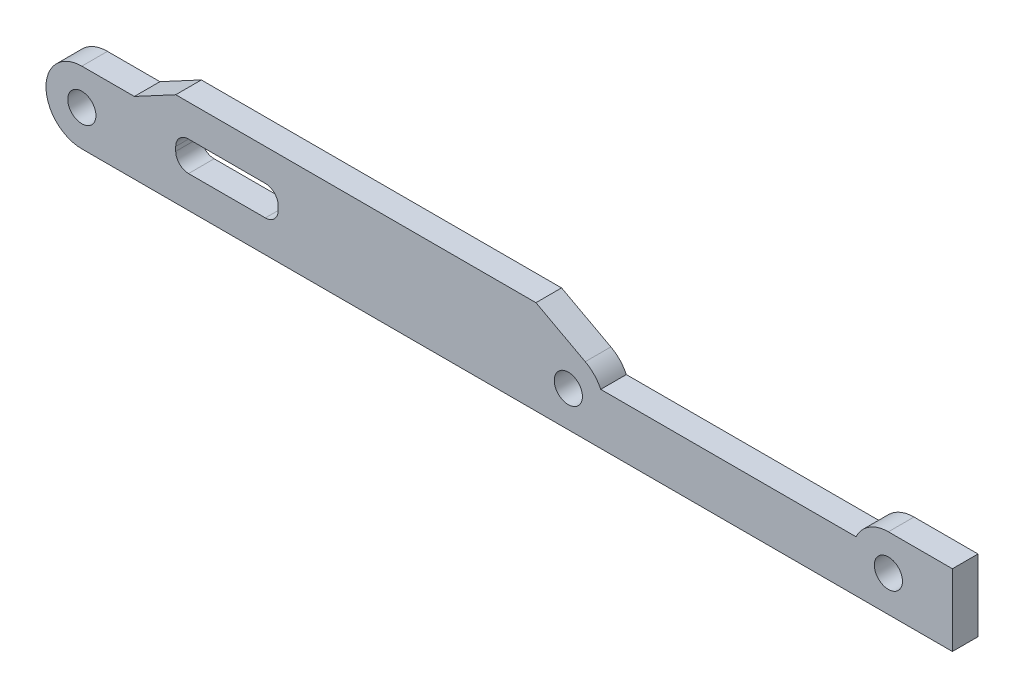
ISO-10303-21;
HEADER;
FILE_DESCRIPTION(('STEP AP214'),'2;1');
FILE_NAME('part.step','',(''),(''),'','','');
FILE_SCHEMA(('AUTOMOTIVE_DESIGN { 1 0 10303 214 1 1 1 1 }'));
ENDSEC;
DATA;
#1=APPLICATION_CONTEXT('core data for automotive mechanical design processes');
#2=APPLICATION_PROTOCOL_DEFINITION('international standard','automotive_design',2000,#1);
#3=PRODUCT_CONTEXT('',#1,'mechanical');
#4=PRODUCT('Part','Part','',(#3));
#5=PRODUCT_RELATED_PRODUCT_CATEGORY('part','',(#4));
#6=PRODUCT_DEFINITION_FORMATION('','',#4);
#7=PRODUCT_DEFINITION_CONTEXT('part definition',#1,'design');
#8=PRODUCT_DEFINITION('design','',#6,#7);
#9=PRODUCT_DEFINITION_SHAPE('','',#8);
#10=(LENGTH_UNIT() NAMED_UNIT(*) SI_UNIT(.MILLI.,.METRE.));
#11=(NAMED_UNIT(*) PLANE_ANGLE_UNIT() SI_UNIT($,.RADIAN.));
#12=(NAMED_UNIT(*) SI_UNIT($,.STERADIAN.) SOLID_ANGLE_UNIT());
#13=UNCERTAINTY_MEASURE_WITH_UNIT(LENGTH_MEASURE(1.E-05),#10,'distance_accuracy_value','');
#14=(GEOMETRIC_REPRESENTATION_CONTEXT(3) GLOBAL_UNCERTAINTY_ASSIGNED_CONTEXT((#13)) GLOBAL_UNIT_ASSIGNED_CONTEXT((#10,
#11,#12)) REPRESENTATION_CONTEXT('',''));
#15=CARTESIAN_POINT('',(0.,0.,0.));
#16=DIRECTION('',(0.,0.,1.));
#17=DIRECTION('',(1.,0.,0.));
#18=AXIS2_PLACEMENT_3D('',#15,#16,#17);
#19=CARTESIAN_POINT('',(-57.,0.,3.));
#20=DIRECTION('',(0.,0.,-1.));
#21=DIRECTION('',(-1.,0.,0.));
#22=AXIS2_PLACEMENT_3D('',#19,#20,#21);
#23=PLANE('',#22);
#24=CARTESIAN_POINT('',(37.5,0.,3.));
#25=DIRECTION('',(0.,0.,1.));
#26=DIRECTION('',(1.,0.,0.));
#27=AXIS2_PLACEMENT_3D('',#24,#25,#26);
#28=CIRCLE('',#27,1.65);
#29=CARTESIAN_POINT('',(39.15,0.,3.));
#30=VERTEX_POINT('',#29);
#31=EDGE_CURVE('E286',#30,#30,#28,.T.);
#32=ORIENTED_EDGE('',*,*,#31,.F.);
#33=EDGE_LOOP('',(#32));
#34=FACE_BOUND('',#33,.T.);
#35=CARTESIAN_POINT('',(0.,0.,3.));
#36=DIRECTION('',(0.,0.,1.));
#37=DIRECTION('',(1.,0.,0.));
#38=AXIS2_PLACEMENT_3D('',#35,#36,#37);
#39=CIRCLE('',#38,1.65);
#40=CARTESIAN_POINT('',(1.65,0.,3.));
#41=VERTEX_POINT('',#40);
#42=EDGE_CURVE('E298',#41,#41,#39,.T.);
#43=ORIENTED_EDGE('',*,*,#42,.F.);
#44=EDGE_LOOP('',(#43));
#45=FACE_BOUND('',#44,.T.);
#46=CARTESIAN_POINT('',(-57.,0.,3.));
#47=DIRECTION('',(0.,0.,1.));
#48=DIRECTION('',(-1.,0.,0.));
#49=AXIS2_PLACEMENT_3D('',#46,#47,#48);
#50=CIRCLE('',#49,4.2);
#51=CARTESIAN_POINT('',(-57.,4.2,3.));
#52=VERTEX_POINT('',#51);
#53=CARTESIAN_POINT('',(-57.,-4.2,3.));
#54=VERTEX_POINT('',#53);
#55=EDGE_CURVE('E190',#52,#54,#50,.T.);
#56=ORIENTED_EDGE('',*,*,#55,.T.);
#57=DIRECTION('',(1.,0.,0.));
#58=VECTOR('',#57,1.);
#59=CARTESIAN_POINT('',(-57.,-4.2,3.));
#60=LINE('',#59,#58);
#61=CARTESIAN_POINT('',(45.,-4.2,3.));
#62=VERTEX_POINT('',#61);
#63=EDGE_CURVE('E178',#54,#62,#60,.T.);
#64=ORIENTED_EDGE('',*,*,#63,.T.);
#65=DIRECTION('',(0.,1.,0.));
#66=VECTOR('',#65,1.);
#67=CARTESIAN_POINT('',(45.,-4.2,3.));
#68=LINE('',#67,#66);
#69=CARTESIAN_POINT('',(45.,4.2,3.));
#70=VERTEX_POINT('',#69);
#71=EDGE_CURVE('E189',#62,#70,#68,.T.);
#72=ORIENTED_EDGE('',*,*,#71,.T.);
#73=DIRECTION('',(-1.,0.,0.));
#74=VECTOR('',#73,1.);
#75=CARTESIAN_POINT('',(37.5,4.2,3.));
#76=LINE('',#75,#74);
#77=CARTESIAN_POINT('',(37.5,4.2,3.));
#78=VERTEX_POINT('',#77);
#79=EDGE_CURVE('E304',#70,#78,#76,.T.);
#80=ORIENTED_EDGE('',*,*,#79,.T.);
#81=CARTESIAN_POINT('',(37.5,0.,3.));
#82=DIRECTION('',(0.,0.,1.));
#83=DIRECTION('',(1.,0.,0.));
#84=AXIS2_PLACEMENT_3D('',#81,#82,#83);
#85=CIRCLE('',#84,4.2);
#86=CARTESIAN_POINT('',(33.7052668077979,1.8,3.));
#87=VERTEX_POINT('',#86);
#88=EDGE_CURVE('E306',#78,#87,#85,.T.);
#89=ORIENTED_EDGE('',*,*,#88,.T.);
#90=DIRECTION('',(-1.,0.,0.));
#91=VECTOR('',#90,1.);
#92=CARTESIAN_POINT('',(3.79473319220206,1.8,3.));
#93=LINE('',#92,#91);
#94=CARTESIAN_POINT('',(3.79473319220206,1.8,3.));
#95=VERTEX_POINT('',#94);
#96=EDGE_CURVE('E308',#87,#95,#93,.T.);
#97=ORIENTED_EDGE('',*,*,#96,.T.);
#98=CARTESIAN_POINT('',(0.,0.,3.));
#99=DIRECTION('',(0.,0.,1.));
#100=DIRECTION('',(1.,0.,0.));
#101=AXIS2_PLACEMENT_3D('',#98,#99,#100);
#102=CIRCLE('',#101,4.2);
#103=CARTESIAN_POINT('',(1.98452095553464,3.70157757949822,3.));
#104=VERTEX_POINT('',#103);
#105=EDGE_CURVE('E310',#95,#104,#102,.T.);
#106=ORIENTED_EDGE('',*,*,#105,.T.);
#107=DIRECTION('',(-0.881327995118623,0.47250498941301,0.));
#108=VECTOR('',#107,1.);
#109=CARTESIAN_POINT('',(-3.79473319220206,6.8,3.));
#110=LINE('',#109,#108);
#111=CARTESIAN_POINT('',(-3.79473319220206,6.8,3.));
#112=VERTEX_POINT('',#111);
#113=EDGE_CURVE('E312',#104,#112,#110,.T.);
#114=ORIENTED_EDGE('',*,*,#113,.T.);
#115=DIRECTION('',(-1.,0.,0.));
#116=VECTOR('',#115,1.);
#117=CARTESIAN_POINT('',(-46.,6.8,3.));
#118=LINE('',#117,#116);
#119=CARTESIAN_POINT('',(-46.,6.8,3.));
#120=VERTEX_POINT('',#119);
#121=EDGE_CURVE('E314',#112,#120,#118,.T.);
#122=ORIENTED_EDGE('',*,*,#121,.T.);
#123=DIRECTION('',(-0.881327995118623,-0.47250498941301,0.));
#124=VECTOR('',#123,1.);
#125=CARTESIAN_POINT('',(-50.8495843190039,4.2,3.));
#126=LINE('',#125,#124);
#127=CARTESIAN_POINT('',(-50.8495843190039,4.2,3.));
#128=VERTEX_POINT('',#127);
#129=EDGE_CURVE('E317',#120,#128,#126,.T.);
#130=ORIENTED_EDGE('',*,*,#129,.T.);
#131=DIRECTION('',(-1.,0.,0.));
#132=VECTOR('',#131,1.);
#133=CARTESIAN_POINT('',(-57.,4.2,3.));
#134=LINE('',#133,#132);
#135=EDGE_CURVE('E195',#128,#52,#134,.T.);
#136=ORIENTED_EDGE('',*,*,#135,.T.);
#137=EDGE_LOOP('',(#56,#64,#72,#80,#89,#97,#106,#114,#122,#130,#136));
#138=FACE_BOUND('',#137,.T.);
#139=CARTESIAN_POINT('',(-57.,0.,3.));
#140=DIRECTION('',(0.,0.,1.));
#141=DIRECTION('',(1.,0.,0.));
#142=AXIS2_PLACEMENT_3D('',#139,#140,#141);
#143=CIRCLE('',#142,1.65);
#144=CARTESIAN_POINT('',(-55.35,0.,3.));
#145=VERTEX_POINT('',#144);
#146=EDGE_CURVE('E292',#145,#145,#143,.T.);
#147=ORIENTED_EDGE('',*,*,#146,.F.);
#148=EDGE_LOOP('',(#147));
#149=FACE_BOUND('',#148,.T.);
#150=DIRECTION('',(0.,1.,0.));
#151=VECTOR('',#150,1.);
#152=CARTESIAN_POINT('',(-34.,-0.450000000000001,3.));
#153=LINE('',#152,#151);
#154=CARTESIAN_POINT('',(-34.,1.04999999999998,3.));
#155=VERTEX_POINT('',#154);
#156=CARTESIAN_POINT('',(-34.,1.54999999999998,3.));
#157=VERTEX_POINT('',#156);
#158=EDGE_CURVE('E257',#155,#157,#153,.T.);
#159=ORIENTED_EDGE('',*,*,#158,.F.);
#160=CARTESIAN_POINT('',(-35.5,1.05,3.));
#161=DIRECTION('',(0.,0.,-1.));
#162=DIRECTION('',(-1.,0.,0.));
#163=AXIS2_PLACEMENT_3D('',#160,#161,#162);
#164=CIRCLE('',#163,1.5);
#165=CARTESIAN_POINT('',(-35.5,-0.450000000000001,3.));
#166=VERTEX_POINT('',#165);
#167=EDGE_CURVE('E57',#155,#166,#164,.T.);
#168=ORIENTED_EDGE('',*,*,#167,.T.);
#169=DIRECTION('',(1.,0.,0.));
#170=VECTOR('',#169,1.);
#171=CARTESIAN_POINT('',(-46.,-0.450000000000001,3.));
#172=LINE('',#171,#170);
#173=CARTESIAN_POINT('',(-44.5,-0.450000000000001,3.));
#174=VERTEX_POINT('',#173);
#175=EDGE_CURVE('E264',#174,#166,#172,.T.);
#176=ORIENTED_EDGE('',*,*,#175,.F.);
#177=CARTESIAN_POINT('',(-44.5,1.05,3.));
#178=DIRECTION('',(0.,0.,-1.));
#179=DIRECTION('',(-1.,0.,0.));
#180=AXIS2_PLACEMENT_3D('',#177,#178,#179);
#181=CIRCLE('',#180,1.5);
#182=CARTESIAN_POINT('',(-46.,1.04999999999999,3.));
#183=VERTEX_POINT('',#182);
#184=EDGE_CURVE('E11',#174,#183,#181,.T.);
#185=ORIENTED_EDGE('',*,*,#184,.T.);
#186=DIRECTION('',(0.,-1.,0.));
#187=VECTOR('',#186,1.);
#188=CARTESIAN_POINT('',(-46.,1.8,3.));
#189=LINE('',#188,#187);
#190=CARTESIAN_POINT('',(-46.,1.54999999999999,3.));
#191=VERTEX_POINT('',#190);
#192=EDGE_CURVE('E262',#191,#183,#189,.T.);
#193=ORIENTED_EDGE('',*,*,#192,.F.);
#194=CARTESIAN_POINT('',(-44.5,1.55,3.));
#195=DIRECTION('',(0.,0.,-1.));
#196=DIRECTION('',(-1.,0.,0.));
#197=AXIS2_PLACEMENT_3D('',#194,#195,#196);
#198=CIRCLE('',#197,1.5);
#199=CARTESIAN_POINT('',(-44.5,3.05,3.));
#200=VERTEX_POINT('',#199);
#201=EDGE_CURVE('E239',#191,#200,#198,.T.);
#202=ORIENTED_EDGE('',*,*,#201,.T.);
#203=DIRECTION('',(-1.,0.,0.));
#204=VECTOR('',#203,1.);
#205=CARTESIAN_POINT('',(-46.,3.05,3.));
#206=LINE('',#205,#204);
#207=CARTESIAN_POINT('',(-35.5,3.05,3.));
#208=VERTEX_POINT('',#207);
#209=EDGE_CURVE('E268',#208,#200,#206,.T.);
#210=ORIENTED_EDGE('',*,*,#209,.F.);
#211=CARTESIAN_POINT('',(-35.5,1.55,3.));
#212=DIRECTION('',(0.,0.,-1.));
#213=DIRECTION('',(-1.,0.,0.));
#214=AXIS2_PLACEMENT_3D('',#211,#212,#213);
#215=CIRCLE('',#214,1.5);
#216=EDGE_CURVE('E233',#208,#157,#215,.T.);
#217=ORIENTED_EDGE('',*,*,#216,.T.);
#218=EDGE_LOOP('',(#159,#168,#176,#185,#193,#202,#210,#217));
#219=FACE_BOUND('',#218,.T.);
#220=ADVANCED_FACE('F41',(#34,#45,#138,#149,#219),#23,.F.);
#221=CARTESIAN_POINT('',(-57.,0.,0.));
#222=DIRECTION('',(0.,0.,-1.));
#223=DIRECTION('',(-1.,0.,0.));
#224=AXIS2_PLACEMENT_3D('',#221,#222,#223);
#225=PLANE('',#224);
#226=CARTESIAN_POINT('',(37.5,0.,0.));
#227=DIRECTION('',(0.,0.,1.));
#228=DIRECTION('',(1.,0.,0.));
#229=AXIS2_PLACEMENT_3D('',#226,#227,#228);
#230=CIRCLE('',#229,1.65);
#231=CARTESIAN_POINT('',(39.15,0.,0.));
#232=VERTEX_POINT('',#231);
#233=EDGE_CURVE('E271',#232,#232,#230,.T.);
#234=ORIENTED_EDGE('',*,*,#233,.T.);
#235=EDGE_LOOP('',(#234));
#236=FACE_BOUND('',#235,.T.);
#237=CARTESIAN_POINT('',(0.,0.,0.));
#238=DIRECTION('',(0.,0.,1.));
#239=DIRECTION('',(1.,0.,0.));
#240=AXIS2_PLACEMENT_3D('',#237,#238,#239);
#241=CIRCLE('',#240,1.65);
#242=CARTESIAN_POINT('',(1.65,0.,0.));
#243=VERTEX_POINT('',#242);
#244=EDGE_CURVE('E295',#243,#243,#241,.T.);
#245=ORIENTED_EDGE('',*,*,#244,.T.);
#246=EDGE_LOOP('',(#245));
#247=FACE_BOUND('',#246,.T.);
#248=CARTESIAN_POINT('',(-57.,0.,0.));
#249=DIRECTION('',(0.,0.,1.));
#250=DIRECTION('',(-1.,0.,0.));
#251=AXIS2_PLACEMENT_3D('',#248,#249,#250);
#252=CIRCLE('',#251,4.2);
#253=CARTESIAN_POINT('',(-57.,4.2,0.));
#254=VERTEX_POINT('',#253);
#255=CARTESIAN_POINT('',(-57.,-4.2,0.));
#256=VERTEX_POINT('',#255);
#257=EDGE_CURVE('E203',#254,#256,#252,.T.);
#258=ORIENTED_EDGE('',*,*,#257,.F.);
#259=DIRECTION('',(-1.,0.,0.));
#260=VECTOR('',#259,1.);
#261=CARTESIAN_POINT('',(-57.,4.2,0.));
#262=LINE('',#261,#260);
#263=CARTESIAN_POINT('',(-50.8495843190039,4.2,0.));
#264=VERTEX_POINT('',#263);
#265=EDGE_CURVE('E199',#264,#254,#262,.T.);
#266=ORIENTED_EDGE('',*,*,#265,.F.);
#267=DIRECTION('',(-0.881327995118623,-0.47250498941301,0.));
#268=VECTOR('',#267,1.);
#269=CARTESIAN_POINT('',(-50.8495843190039,4.2,0.));
#270=LINE('',#269,#268);
#271=CARTESIAN_POINT('',(-46.,6.8,0.));
#272=VERTEX_POINT('',#271);
#273=EDGE_CURVE('E340',#272,#264,#270,.T.);
#274=ORIENTED_EDGE('',*,*,#273,.F.);
#275=DIRECTION('',(-1.,0.,0.));
#276=VECTOR('',#275,1.);
#277=CARTESIAN_POINT('',(-46.,6.8,0.));
#278=LINE('',#277,#276);
#279=CARTESIAN_POINT('',(-3.79473319220206,6.8,0.));
#280=VERTEX_POINT('',#279);
#281=EDGE_CURVE('E337',#280,#272,#278,.T.);
#282=ORIENTED_EDGE('',*,*,#281,.F.);
#283=DIRECTION('',(-0.881327995118623,0.47250498941301,0.));
#284=VECTOR('',#283,1.);
#285=CARTESIAN_POINT('',(-3.79473319220206,6.8,0.));
#286=LINE('',#285,#284);
#287=CARTESIAN_POINT('',(1.98452095553464,3.70157757949822,0.));
#288=VERTEX_POINT('',#287);
#289=EDGE_CURVE('E335',#288,#280,#286,.T.);
#290=ORIENTED_EDGE('',*,*,#289,.F.);
#291=CARTESIAN_POINT('',(0.,0.,0.));
#292=DIRECTION('',(0.,0.,1.));
#293=DIRECTION('',(1.,0.,0.));
#294=AXIS2_PLACEMENT_3D('',#291,#292,#293);
#295=CIRCLE('',#294,4.2);
#296=CARTESIAN_POINT('',(3.79473319220206,1.8,0.));
#297=VERTEX_POINT('',#296);
#298=EDGE_CURVE('E333',#297,#288,#295,.T.);
#299=ORIENTED_EDGE('',*,*,#298,.F.);
#300=DIRECTION('',(-1.,0.,0.));
#301=VECTOR('',#300,1.);
#302=CARTESIAN_POINT('',(3.79473319220206,1.8,0.));
#303=LINE('',#302,#301);
#304=CARTESIAN_POINT('',(33.7052668077979,1.8,0.));
#305=VERTEX_POINT('',#304);
#306=EDGE_CURVE('E331',#305,#297,#303,.T.);
#307=ORIENTED_EDGE('',*,*,#306,.F.);
#308=CARTESIAN_POINT('',(37.5,0.,0.));
#309=DIRECTION('',(0.,0.,1.));
#310=DIRECTION('',(1.,0.,0.));
#311=AXIS2_PLACEMENT_3D('',#308,#309,#310);
#312=CIRCLE('',#311,4.2);
#313=CARTESIAN_POINT('',(37.5,4.2,0.));
#314=VERTEX_POINT('',#313);
#315=EDGE_CURVE('E329',#314,#305,#312,.T.);
#316=ORIENTED_EDGE('',*,*,#315,.F.);
#317=DIRECTION('',(-1.,0.,0.));
#318=VECTOR('',#317,1.);
#319=CARTESIAN_POINT('',(37.5,4.2,0.));
#320=LINE('',#319,#318);
#321=CARTESIAN_POINT('',(45.,4.2,0.));
#322=VERTEX_POINT('',#321);
#323=EDGE_CURVE('E327',#322,#314,#320,.T.);
#324=ORIENTED_EDGE('',*,*,#323,.F.);
#325=DIRECTION('',(0.,1.,0.));
#326=VECTOR('',#325,1.);
#327=CARTESIAN_POINT('',(45.,-4.2,0.));
#328=LINE('',#327,#326);
#329=CARTESIAN_POINT('',(45.,-4.2,0.));
#330=VERTEX_POINT('',#329);
#331=EDGE_CURVE('E325',#330,#322,#328,.T.);
#332=ORIENTED_EDGE('',*,*,#331,.F.);
#333=DIRECTION('',(1.,0.,0.));
#334=VECTOR('',#333,1.);
#335=CARTESIAN_POINT('',(-57.,-4.2,0.));
#336=LINE('',#335,#334);
#337=EDGE_CURVE('E322',#256,#330,#336,.T.);
#338=ORIENTED_EDGE('',*,*,#337,.F.);
#339=EDGE_LOOP('',(#258,#266,#274,#282,#290,#299,#307,#316,#324,#332,#338));
#340=FACE_BOUND('',#339,.T.);
#341=CARTESIAN_POINT('',(-57.,0.,0.));
#342=DIRECTION('',(0.,0.,1.));
#343=DIRECTION('',(1.,0.,0.));
#344=AXIS2_PLACEMENT_3D('',#341,#342,#343);
#345=CIRCLE('',#344,1.65);
#346=CARTESIAN_POINT('',(-55.35,0.,0.));
#347=VERTEX_POINT('',#346);
#348=EDGE_CURVE('E289',#347,#347,#345,.T.);
#349=ORIENTED_EDGE('',*,*,#348,.T.);
#350=EDGE_LOOP('',(#349));
#351=FACE_BOUND('',#350,.T.);
#352=DIRECTION('',(0.,-1.,0.));
#353=VECTOR('',#352,1.);
#354=CARTESIAN_POINT('',(-46.,1.8,0.));
#355=LINE('',#354,#353);
#356=CARTESIAN_POINT('',(-46.,1.54999999999999,0.));
#357=VERTEX_POINT('',#356);
#358=CARTESIAN_POINT('',(-46.,1.04999999999999,0.));
#359=VERTEX_POINT('',#358);
#360=EDGE_CURVE('E252',#357,#359,#355,.T.);
#361=ORIENTED_EDGE('',*,*,#360,.T.);
#362=CARTESIAN_POINT('',(-44.5,1.05,0.));
#363=DIRECTION('',(0.,0.,-1.));
#364=DIRECTION('',(-1.,0.,0.));
#365=AXIS2_PLACEMENT_3D('',#362,#363,#364);
#366=CIRCLE('',#365,1.5);
#367=CARTESIAN_POINT('',(-44.5,-0.450000000000001,0.));
#368=VERTEX_POINT('',#367);
#369=EDGE_CURVE('E50',#359,#368,#366,.F.);
#370=ORIENTED_EDGE('',*,*,#369,.T.);
#371=DIRECTION('',(1.,0.,0.));
#372=VECTOR('',#371,1.);
#373=CARTESIAN_POINT('',(-46.,-0.450000000000001,0.));
#374=LINE('',#373,#372);
#375=CARTESIAN_POINT('',(-35.5,-0.450000000000001,0.));
#376=VERTEX_POINT('',#375);
#377=EDGE_CURVE('E250',#368,#376,#374,.T.);
#378=ORIENTED_EDGE('',*,*,#377,.T.);
#379=CARTESIAN_POINT('',(-35.5,1.05,0.));
#380=DIRECTION('',(0.,0.,-1.));
#381=DIRECTION('',(-1.,0.,0.));
#382=AXIS2_PLACEMENT_3D('',#379,#380,#381);
#383=CIRCLE('',#382,1.5);
#384=CARTESIAN_POINT('',(-34.,1.04999999999998,0.));
#385=VERTEX_POINT('',#384);
#386=EDGE_CURVE('E242',#376,#385,#383,.F.);
#387=ORIENTED_EDGE('',*,*,#386,.T.);
#388=DIRECTION('',(0.,1.,0.));
#389=VECTOR('',#388,1.);
#390=CARTESIAN_POINT('',(-34.,3.05,0.));
#391=LINE('',#390,#389);
#392=CARTESIAN_POINT('',(-34.,1.54999999999998,0.));
#393=VERTEX_POINT('',#392);
#394=EDGE_CURVE('E278',#385,#393,#391,.T.);
#395=ORIENTED_EDGE('',*,*,#394,.T.);
#396=CARTESIAN_POINT('',(-35.5,1.55,0.));
#397=DIRECTION('',(0.,0.,-1.));
#398=DIRECTION('',(-1.,0.,0.));
#399=AXIS2_PLACEMENT_3D('',#396,#397,#398);
#400=CIRCLE('',#399,1.5);
#401=CARTESIAN_POINT('',(-35.5,3.05,0.));
#402=VERTEX_POINT('',#401);
#403=EDGE_CURVE('E230',#393,#402,#400,.F.);
#404=ORIENTED_EDGE('',*,*,#403,.T.);
#405=DIRECTION('',(-1.,0.,0.));
#406=VECTOR('',#405,1.);
#407=CARTESIAN_POINT('',(-46.,3.05,0.));
#408=LINE('',#407,#406);
#409=CARTESIAN_POINT('',(-44.5,3.05,0.));
#410=VERTEX_POINT('',#409);
#411=EDGE_CURVE('E281',#402,#410,#408,.T.);
#412=ORIENTED_EDGE('',*,*,#411,.T.);
#413=CARTESIAN_POINT('',(-44.5,1.55,0.));
#414=DIRECTION('',(0.,0.,-1.));
#415=DIRECTION('',(-1.,0.,0.));
#416=AXIS2_PLACEMENT_3D('',#413,#414,#415);
#417=CIRCLE('',#416,1.5);
#418=EDGE_CURVE('E236',#410,#357,#417,.F.);
#419=ORIENTED_EDGE('',*,*,#418,.T.);
#420=EDGE_LOOP('',(#361,#370,#378,#387,#395,#404,#412,#419));
#421=FACE_BOUND('',#420,.T.);
#422=ADVANCED_FACE('F249',(#236,#247,#340,#351,#421),#225,.T.);
#423=CARTESIAN_POINT('',(-57.,0.,3.));
#424=DIRECTION('',(0.,0.,-1.));
#425=DIRECTION('',(-1.,0.,0.));
#426=AXIS2_PLACEMENT_3D('',#423,#424,#425);
#427=CYLINDRICAL_SURFACE('',#426,4.2);
#428=ORIENTED_EDGE('',*,*,#257,.T.);
#429=DIRECTION('',(0.,0.,-1.));
#430=VECTOR('',#429,1.);
#431=CARTESIAN_POINT('',(-57.,-4.2,3.));
#432=LINE('',#431,#430);
#433=EDGE_CURVE('E182',#54,#256,#432,.T.);
#434=ORIENTED_EDGE('',*,*,#433,.F.);
#435=ORIENTED_EDGE('',*,*,#55,.F.);
#436=DIRECTION('',(0.,0.,-1.));
#437=VECTOR('',#436,1.);
#438=CARTESIAN_POINT('',(-57.,4.2,3.));
#439=LINE('',#438,#437);
#440=EDGE_CURVE('E320',#52,#254,#439,.T.);
#441=ORIENTED_EDGE('',*,*,#440,.T.);
#442=EDGE_LOOP('',(#428,#434,#435,#441));
#443=FACE_BOUND('',#442,.T.);
#444=ADVANCED_FACE('F201',(#443),#427,.T.);
#445=CARTESIAN_POINT('',(-57.,-4.2,3.));
#446=DIRECTION('',(0.,1.,0.));
#447=DIRECTION('',(0.,0.,1.));
#448=AXIS2_PLACEMENT_3D('',#445,#446,#447);
#449=PLANE('',#448);
#450=ORIENTED_EDGE('',*,*,#337,.T.);
#451=DIRECTION('',(0.,0.,-1.));
#452=VECTOR('',#451,1.);
#453=CARTESIAN_POINT('',(45.,-4.2,3.));
#454=LINE('',#453,#452);
#455=EDGE_CURVE('E185',#62,#330,#454,.T.);
#456=ORIENTED_EDGE('',*,*,#455,.F.);
#457=ORIENTED_EDGE('',*,*,#63,.F.);
#458=ORIENTED_EDGE('',*,*,#433,.T.);
#459=EDGE_LOOP('',(#450,#456,#457,#458));
#460=FACE_BOUND('',#459,.T.);
#461=ADVANCED_FACE('F180',(#460),#449,.F.);
#462=CARTESIAN_POINT('',(45.,-4.2,3.));
#463=DIRECTION('',(-1.,0.,0.));
#464=DIRECTION('',(0.,0.,1.));
#465=AXIS2_PLACEMENT_3D('',#462,#463,#464);
#466=PLANE('',#465);
#467=ORIENTED_EDGE('',*,*,#331,.T.);
#468=DIRECTION('',(0.,0.,-1.));
#469=VECTOR('',#468,1.);
#470=CARTESIAN_POINT('',(45.,4.2,3.));
#471=LINE('',#470,#469);
#472=EDGE_CURVE('E208',#70,#322,#471,.T.);
#473=ORIENTED_EDGE('',*,*,#472,.F.);
#474=ORIENTED_EDGE('',*,*,#71,.F.);
#475=ORIENTED_EDGE('',*,*,#455,.T.);
#476=EDGE_LOOP('',(#467,#473,#474,#475));
#477=FACE_BOUND('',#476,.T.);
#478=ADVANCED_FACE('F388',(#477),#466,.F.);
#479=CARTESIAN_POINT('',(37.5,4.2,3.));
#480=DIRECTION('',(0.,-1.,0.));
#481=DIRECTION('',(1.,0.,0.));
#482=AXIS2_PLACEMENT_3D('',#479,#480,#481);
#483=PLANE('',#482);
#484=ORIENTED_EDGE('',*,*,#323,.T.);
#485=DIRECTION('',(0.,0.,-1.));
#486=VECTOR('',#485,1.);
#487=CARTESIAN_POINT('',(37.5,4.2,3.));
#488=LINE('',#487,#486);
#489=EDGE_CURVE('E362',#78,#314,#488,.T.);
#490=ORIENTED_EDGE('',*,*,#489,.F.);
#491=ORIENTED_EDGE('',*,*,#79,.F.);
#492=ORIENTED_EDGE('',*,*,#472,.T.);
#493=EDGE_LOOP('',(#484,#490,#491,#492));
#494=FACE_BOUND('',#493,.T.);
#495=ADVANCED_FACE('F369',(#494),#483,.F.);
#496=CARTESIAN_POINT('',(37.5,0.,3.));
#497=DIRECTION('',(0.,0.,-1.));
#498=DIRECTION('',(-1.,0.,0.));
#499=AXIS2_PLACEMENT_3D('',#496,#497,#498);
#500=CYLINDRICAL_SURFACE('',#499,4.2);
#501=ORIENTED_EDGE('',*,*,#315,.T.);
#502=DIRECTION('',(0.,0.,-1.));
#503=VECTOR('',#502,1.);
#504=CARTESIAN_POINT('',(33.7052668077979,1.8,3.));
#505=LINE('',#504,#503);
#506=EDGE_CURVE('E359',#87,#305,#505,.T.);
#507=ORIENTED_EDGE('',*,*,#506,.F.);
#508=ORIENTED_EDGE('',*,*,#88,.F.);
#509=ORIENTED_EDGE('',*,*,#489,.T.);
#510=EDGE_LOOP('',(#501,#507,#508,#509));
#511=FACE_BOUND('',#510,.T.);
#512=ADVANCED_FACE('F380',(#511),#500,.T.);
#513=CARTESIAN_POINT('',(3.79473319220206,1.8,3.));
#514=DIRECTION('',(0.,-1.,0.));
#515=DIRECTION('',(0.,0.,-1.));
#516=AXIS2_PLACEMENT_3D('',#513,#514,#515);
#517=PLANE('',#516);
#518=ORIENTED_EDGE('',*,*,#306,.T.);
#519=DIRECTION('',(0.,0.,-1.));
#520=VECTOR('',#519,1.);
#521=CARTESIAN_POINT('',(3.79473319220206,1.8,3.));
#522=LINE('',#521,#520);
#523=EDGE_CURVE('E356',#95,#297,#522,.T.);
#524=ORIENTED_EDGE('',*,*,#523,.F.);
#525=ORIENTED_EDGE('',*,*,#96,.F.);
#526=ORIENTED_EDGE('',*,*,#506,.T.);
#527=EDGE_LOOP('',(#518,#524,#525,#526));
#528=FACE_BOUND('',#527,.T.);
#529=ADVANCED_FACE('F384',(#528),#517,.F.);
#530=CARTESIAN_POINT('',(0.,0.,3.));
#531=DIRECTION('',(0.,0.,-1.));
#532=DIRECTION('',(-1.,0.,0.));
#533=AXIS2_PLACEMENT_3D('',#530,#531,#532);
#534=CYLINDRICAL_SURFACE('',#533,4.2);
#535=ORIENTED_EDGE('',*,*,#298,.T.);
#536=DIRECTION('',(0.,0.,-1.));
#537=VECTOR('',#536,1.);
#538=CARTESIAN_POINT('',(1.98452095553464,3.70157757949822,3.));
#539=LINE('',#538,#537);
#540=EDGE_CURVE('E353',#104,#288,#539,.T.);
#541=ORIENTED_EDGE('',*,*,#540,.F.);
#542=ORIENTED_EDGE('',*,*,#105,.F.);
#543=ORIENTED_EDGE('',*,*,#523,.T.);
#544=EDGE_LOOP('',(#535,#541,#542,#543));
#545=FACE_BOUND('',#544,.T.);
#546=ADVANCED_FACE('F426',(#545),#534,.T.);
#547=CARTESIAN_POINT('',(-3.79473319220206,6.8,3.));
#548=DIRECTION('',(-0.47250498941301,-0.881327995118623,0.));
#549=DIRECTION('',(0.881327995118623,-0.47250498941301,0.));
#550=AXIS2_PLACEMENT_3D('',#547,#548,#549);
#551=PLANE('',#550);
#552=ORIENTED_EDGE('',*,*,#289,.T.);
#553=DIRECTION('',(0.,0.,-1.));
#554=VECTOR('',#553,1.);
#555=CARTESIAN_POINT('',(-3.79473319220206,6.8,3.));
#556=LINE('',#555,#554);
#557=EDGE_CURVE('E350',#112,#280,#556,.T.);
#558=ORIENTED_EDGE('',*,*,#557,.F.);
#559=ORIENTED_EDGE('',*,*,#113,.F.);
#560=ORIENTED_EDGE('',*,*,#540,.T.);
#561=EDGE_LOOP('',(#552,#558,#559,#560));
#562=FACE_BOUND('',#561,.T.);
#563=ADVANCED_FACE('F422',(#562),#551,.F.);
#564=CARTESIAN_POINT('',(-46.,6.8,3.));
#565=DIRECTION('',(0.,-1.,0.));
#566=DIRECTION('',(0.,0.,-1.));
#567=AXIS2_PLACEMENT_3D('',#564,#565,#566);
#568=PLANE('',#567);
#569=ORIENTED_EDGE('',*,*,#281,.T.);
#570=DIRECTION('',(0.,0.,-1.));
#571=VECTOR('',#570,1.);
#572=CARTESIAN_POINT('',(-46.,6.8,3.));
#573=LINE('',#572,#571);
#574=EDGE_CURVE('E347',#120,#272,#573,.T.);
#575=ORIENTED_EDGE('',*,*,#574,.F.);
#576=ORIENTED_EDGE('',*,*,#121,.F.);
#577=ORIENTED_EDGE('',*,*,#557,.T.);
#578=EDGE_LOOP('',(#569,#575,#576,#577));
#579=FACE_BOUND('',#578,.T.);
#580=ADVANCED_FACE('F418',(#579),#568,.F.);
#581=CARTESIAN_POINT('',(-50.8495843190039,4.2,3.));
#582=DIRECTION('',(0.47250498941301,-0.881327995118623,0.));
#583=DIRECTION('',(0.881327995118623,0.47250498941301,0.));
#584=AXIS2_PLACEMENT_3D('',#581,#582,#583);
#585=PLANE('',#584);
#586=ORIENTED_EDGE('',*,*,#273,.T.);
#587=DIRECTION('',(0.,0.,-1.));
#588=VECTOR('',#587,1.);
#589=CARTESIAN_POINT('',(-50.8495843190039,4.2,3.));
#590=LINE('',#589,#588);
#591=EDGE_CURVE('E344',#128,#264,#590,.T.);
#592=ORIENTED_EDGE('',*,*,#591,.F.);
#593=ORIENTED_EDGE('',*,*,#129,.F.);
#594=ORIENTED_EDGE('',*,*,#574,.T.);
#595=EDGE_LOOP('',(#586,#592,#593,#594));
#596=FACE_BOUND('',#595,.T.);
#597=ADVANCED_FACE('F414',(#596),#585,.F.);
#598=CARTESIAN_POINT('',(-57.,4.2,3.));
#599=DIRECTION('',(0.,-1.,0.));
#600=DIRECTION('',(1.,0.,0.));
#601=AXIS2_PLACEMENT_3D('',#598,#599,#600);
#602=PLANE('',#601);
#603=ORIENTED_EDGE('',*,*,#265,.T.);
#604=ORIENTED_EDGE('',*,*,#440,.F.);
#605=ORIENTED_EDGE('',*,*,#135,.F.);
#606=ORIENTED_EDGE('',*,*,#591,.T.);
#607=EDGE_LOOP('',(#603,#604,#605,#606));
#608=FACE_BOUND('',#607,.T.);
#609=ADVANCED_FACE('F411',(#608),#602,.F.);
#610=CARTESIAN_POINT('',(0.,0.,3.));
#611=DIRECTION('',(0.,0.,-1.));
#612=DIRECTION('',(-1.,0.,0.));
#613=AXIS2_PLACEMENT_3D('',#610,#611,#612);
#614=CYLINDRICAL_SURFACE('',#613,1.65);
#615=ORIENTED_EDGE('',*,*,#42,.T.);
#616=EDGE_LOOP('',(#615));
#617=FACE_BOUND('',#616,.T.);
#618=ORIENTED_EDGE('',*,*,#244,.F.);
#619=EDGE_LOOP('',(#618));
#620=FACE_BOUND('',#619,.T.);
#621=ADVANCED_FACE('F408',(#617,#620),#614,.F.);
#622=CARTESIAN_POINT('',(-57.,0.,3.));
#623=DIRECTION('',(0.,0.,-1.));
#624=DIRECTION('',(-1.,0.,0.));
#625=AXIS2_PLACEMENT_3D('',#622,#623,#624);
#626=CYLINDRICAL_SURFACE('',#625,1.65);
#627=ORIENTED_EDGE('',*,*,#146,.T.);
#628=EDGE_LOOP('',(#627));
#629=FACE_BOUND('',#628,.T.);
#630=ORIENTED_EDGE('',*,*,#348,.F.);
#631=EDGE_LOOP('',(#630));
#632=FACE_BOUND('',#631,.T.);
#633=ADVANCED_FACE('F468',(#629,#632),#626,.F.);
#634=CARTESIAN_POINT('',(37.5,0.,3.));
#635=DIRECTION('',(0.,0.,-1.));
#636=DIRECTION('',(-1.,0.,0.));
#637=AXIS2_PLACEMENT_3D('',#634,#635,#636);
#638=CYLINDRICAL_SURFACE('',#637,1.65);
#639=ORIENTED_EDGE('',*,*,#31,.T.);
#640=EDGE_LOOP('',(#639));
#641=FACE_BOUND('',#640,.T.);
#642=ORIENTED_EDGE('',*,*,#233,.F.);
#643=EDGE_LOOP('',(#642));
#644=FACE_BOUND('',#643,.T.);
#645=ADVANCED_FACE('F475',(#641,#644),#638,.F.);
#646=CARTESIAN_POINT('',(-34.,3.05,3.));
#647=DIRECTION('',(-1.,0.,0.));
#648=DIRECTION('',(0.,-1.,0.));
#649=AXIS2_PLACEMENT_3D('',#646,#647,#648);
#650=PLANE('',#649);
#651=ORIENTED_EDGE('',*,*,#158,.T.);
#652=DIRECTION('',(0.,0.,-1.));
#653=VECTOR('',#652,1.);
#654=CARTESIAN_POINT('',(-34.,1.54999999999998,0.));
#655=LINE('',#654,#653);
#656=EDGE_CURVE('E206',#157,#393,#655,.T.);
#657=ORIENTED_EDGE('',*,*,#656,.T.);
#658=ORIENTED_EDGE('',*,*,#394,.F.);
#659=DIRECTION('',(0.,0.,-1.));
#660=VECTOR('',#659,1.);
#661=CARTESIAN_POINT('',(-34.,1.04999999999998,3.));
#662=LINE('',#661,#660);
#663=EDGE_CURVE('E204',#385,#155,#662,.F.);
#664=ORIENTED_EDGE('',*,*,#663,.T.);
#665=EDGE_LOOP('',(#651,#657,#658,#664));
#666=FACE_BOUND('',#665,.T.);
#667=ADVANCED_FACE('F482',(#666),#650,.T.);
#668=CARTESIAN_POINT('',(-46.,3.05,3.));
#669=DIRECTION('',(0.,-1.,0.));
#670=DIRECTION('',(0.,0.,-1.));
#671=AXIS2_PLACEMENT_3D('',#668,#669,#670);
#672=PLANE('',#671);
#673=ORIENTED_EDGE('',*,*,#411,.F.);
#674=DIRECTION('',(0.,0.,-1.));
#675=VECTOR('',#674,1.);
#676=CARTESIAN_POINT('',(-35.5,3.05,3.));
#677=LINE('',#676,#675);
#678=EDGE_CURVE('E218',#402,#208,#677,.F.);
#679=ORIENTED_EDGE('',*,*,#678,.T.);
#680=ORIENTED_EDGE('',*,*,#209,.T.);
#681=DIRECTION('',(0.,0.,-1.));
#682=VECTOR('',#681,1.);
#683=CARTESIAN_POINT('',(-44.5,3.05,0.));
#684=LINE('',#683,#682);
#685=EDGE_CURVE('E214',#200,#410,#684,.T.);
#686=ORIENTED_EDGE('',*,*,#685,.T.);
#687=EDGE_LOOP('',(#673,#679,#680,#686));
#688=FACE_BOUND('',#687,.T.);
#689=ADVANCED_FACE('F491',(#688),#672,.T.);
#690=CARTESIAN_POINT('',(-46.,1.8,3.));
#691=DIRECTION('',(1.,0.,0.));
#692=DIRECTION('',(0.,1.,0.));
#693=AXIS2_PLACEMENT_3D('',#690,#691,#692);
#694=PLANE('',#693);
#695=ORIENTED_EDGE('',*,*,#360,.F.);
#696=DIRECTION('',(0.,0.,-1.));
#697=VECTOR('',#696,1.);
#698=CARTESIAN_POINT('',(-46.,1.54999999999999,3.));
#699=LINE('',#698,#697);
#700=EDGE_CURVE('E223',#357,#191,#699,.F.);
#701=ORIENTED_EDGE('',*,*,#700,.T.);
#702=ORIENTED_EDGE('',*,*,#192,.T.);
#703=DIRECTION('',(0.,0.,-1.));
#704=VECTOR('',#703,1.);
#705=CARTESIAN_POINT('',(-46.,1.04999999999999,0.));
#706=LINE('',#705,#704);
#707=EDGE_CURVE('E220',#183,#359,#706,.T.);
#708=ORIENTED_EDGE('',*,*,#707,.T.);
#709=EDGE_LOOP('',(#695,#701,#702,#708));
#710=FACE_BOUND('',#709,.T.);
#711=ADVANCED_FACE('F266',(#710),#694,.T.);
#712=CARTESIAN_POINT('',(-46.,-0.450000000000001,3.));
#713=DIRECTION('',(0.,1.,0.));
#714=DIRECTION('',(0.,0.,1.));
#715=AXIS2_PLACEMENT_3D('',#712,#713,#714);
#716=PLANE('',#715);
#717=ORIENTED_EDGE('',*,*,#175,.T.);
#718=DIRECTION('',(0.,0.,-1.));
#719=VECTOR('',#718,1.);
#720=CARTESIAN_POINT('',(-35.5,-0.450000000000001,0.));
#721=LINE('',#720,#719);
#722=EDGE_CURVE('E227',#166,#376,#721,.T.);
#723=ORIENTED_EDGE('',*,*,#722,.T.);
#724=ORIENTED_EDGE('',*,*,#377,.F.);
#725=DIRECTION('',(0.,0.,-1.));
#726=VECTOR('',#725,1.);
#727=CARTESIAN_POINT('',(-44.5,-0.450000000000001,3.));
#728=LINE('',#727,#726);
#729=EDGE_CURVE('E66',#368,#174,#728,.F.);
#730=ORIENTED_EDGE('',*,*,#729,.T.);
#731=EDGE_LOOP('',(#717,#723,#724,#730));
#732=FACE_BOUND('',#731,.T.);
#733=ADVANCED_FACE('F255',(#732),#716,.T.);
#734=CARTESIAN_POINT('',(-35.5,1.55,3.));
#735=DIRECTION('',(0.,0.,1.));
#736=DIRECTION('',(1.,0.,0.));
#737=AXIS2_PLACEMENT_3D('',#734,#735,#736);
#738=CYLINDRICAL_SURFACE('',#737,1.5);
#739=ORIENTED_EDGE('',*,*,#216,.F.);
#740=ORIENTED_EDGE('',*,*,#678,.F.);
#741=ORIENTED_EDGE('',*,*,#403,.F.);
#742=ORIENTED_EDGE('',*,*,#656,.F.);
#743=EDGE_LOOP('',(#739,#740,#741,#742));
#744=FACE_BOUND('',#743,.T.);
#745=ADVANCED_FACE('F513',(#744),#738,.F.);
#746=CARTESIAN_POINT('',(-44.5,1.55,3.));
#747=DIRECTION('',(0.,0.,1.));
#748=DIRECTION('',(1.,0.,0.));
#749=AXIS2_PLACEMENT_3D('',#746,#747,#748);
#750=CYLINDRICAL_SURFACE('',#749,1.5);
#751=ORIENTED_EDGE('',*,*,#201,.F.);
#752=ORIENTED_EDGE('',*,*,#700,.F.);
#753=ORIENTED_EDGE('',*,*,#418,.F.);
#754=ORIENTED_EDGE('',*,*,#685,.F.);
#755=EDGE_LOOP('',(#751,#752,#753,#754));
#756=FACE_BOUND('',#755,.T.);
#757=ADVANCED_FACE('F520',(#756),#750,.F.);
#758=CARTESIAN_POINT('',(-35.5,1.05,3.));
#759=DIRECTION('',(0.,0.,1.));
#760=DIRECTION('',(1.,0.,0.));
#761=AXIS2_PLACEMENT_3D('',#758,#759,#760);
#762=CYLINDRICAL_SURFACE('',#761,1.5);
#763=ORIENTED_EDGE('',*,*,#167,.F.);
#764=ORIENTED_EDGE('',*,*,#663,.F.);
#765=ORIENTED_EDGE('',*,*,#386,.F.);
#766=ORIENTED_EDGE('',*,*,#722,.F.);
#767=EDGE_LOOP('',(#763,#764,#765,#766));
#768=FACE_BOUND('',#767,.T.);
#769=ADVANCED_FACE('F528',(#768),#762,.F.);
#770=CARTESIAN_POINT('',(-44.5,1.05,3.));
#771=DIRECTION('',(0.,0.,1.));
#772=DIRECTION('',(1.,0.,0.));
#773=AXIS2_PLACEMENT_3D('',#770,#771,#772);
#774=CYLINDRICAL_SURFACE('',#773,1.5);
#775=ORIENTED_EDGE('',*,*,#184,.F.);
#776=ORIENTED_EDGE('',*,*,#729,.F.);
#777=ORIENTED_EDGE('',*,*,#369,.F.);
#778=ORIENTED_EDGE('',*,*,#707,.F.);
#779=EDGE_LOOP('',(#775,#776,#777,#778));
#780=FACE_BOUND('',#779,.T.);
#781=ADVANCED_FACE('F43',(#780),#774,.F.);
#782=CLOSED_SHELL('',(#220,#422,#444,#461,#478,#495,#512,#529,#546,#563,#580,#597,#609,#621,
#633,#645,#667,#689,#711,#733,#745,#757,#769,#781));
#783=MANIFOLD_SOLID_BREP('B2',#782);
#784=ADVANCED_BREP_SHAPE_REPRESENTATION('',(#18,#783),#14);
#785=SHAPE_DEFINITION_REPRESENTATION(#9,#784);
ENDSEC;
END-ISO-10303-21;
